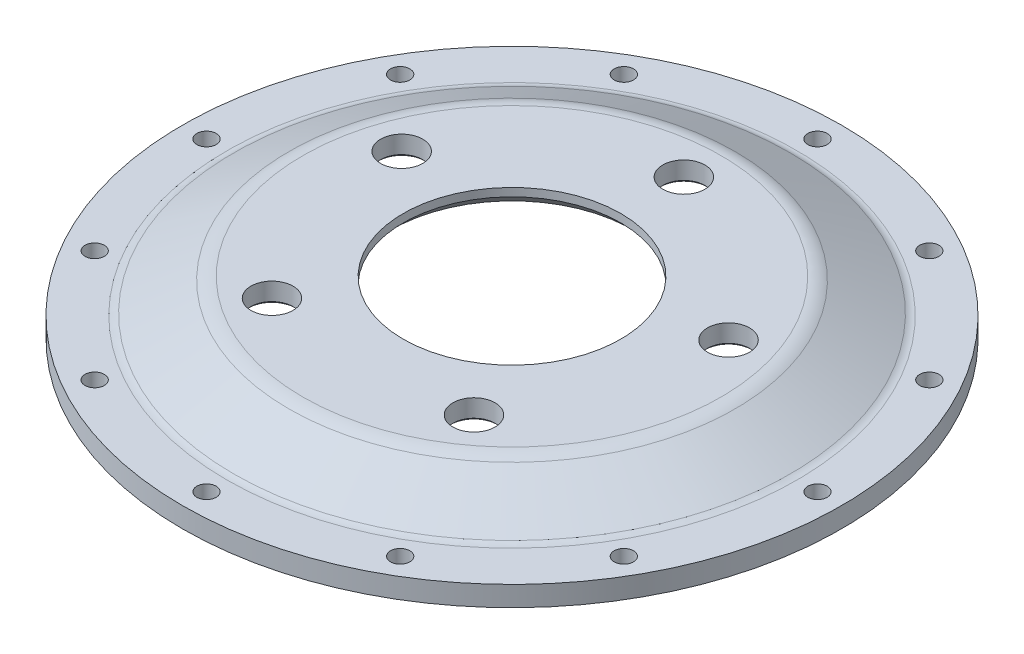
ISO-10303-21;
HEADER;
FILE_DESCRIPTION(('STEP AP214'),'2;1');
FILE_NAME('part.step','',(''),(''),'','','');
FILE_SCHEMA(('AUTOMOTIVE_DESIGN { 1 0 10303 214 1 1 1 1 }'));
ENDSEC;
DATA;
#1=APPLICATION_CONTEXT('core data for automotive mechanical design processes');
#2=APPLICATION_PROTOCOL_DEFINITION('international standard','automotive_design',2000,#1);
#3=PRODUCT_CONTEXT('',#1,'mechanical');
#4=PRODUCT('Part','Part','',(#3));
#5=PRODUCT_RELATED_PRODUCT_CATEGORY('part','',(#4));
#6=PRODUCT_DEFINITION_FORMATION('','',#4);
#7=PRODUCT_DEFINITION_CONTEXT('part definition',#1,'design');
#8=PRODUCT_DEFINITION('design','',#6,#7);
#9=PRODUCT_DEFINITION_SHAPE('','',#8);
#10=(LENGTH_UNIT() NAMED_UNIT(*) SI_UNIT(.MILLI.,.METRE.));
#11=(NAMED_UNIT(*) PLANE_ANGLE_UNIT() SI_UNIT($,.RADIAN.));
#12=(NAMED_UNIT(*) SI_UNIT($,.STERADIAN.) SOLID_ANGLE_UNIT());
#13=UNCERTAINTY_MEASURE_WITH_UNIT(LENGTH_MEASURE(1.E-05),#10,'distance_accuracy_value','');
#14=(GEOMETRIC_REPRESENTATION_CONTEXT(3) GLOBAL_UNCERTAINTY_ASSIGNED_CONTEXT((#13)) GLOBAL_UNIT_ASSIGNED_CONTEXT((#10,
#11,#12)) REPRESENTATION_CONTEXT('',''));
#15=CARTESIAN_POINT('',(0.,0.,0.));
#16=DIRECTION('',(0.,0.,1.));
#17=DIRECTION('',(1.,0.,0.));
#18=AXIS2_PLACEMENT_3D('',#15,#16,#17);
#19=CARTESIAN_POINT('',(0.,6.7,0.));
#20=DIRECTION('',(0.,1.,0.));
#21=DIRECTION('',(0.,0.,1.));
#22=AXIS2_PLACEMENT_3D('',#19,#20,#21);
#23=PLANE('',#22);
#24=CARTESIAN_POINT('',(0.,6.7,0.));
#25=DIRECTION('',(0.,1.,0.));
#26=DIRECTION('',(0.,0.,1.));
#27=AXIS2_PLACEMENT_3D('',#24,#25,#26);
#28=CIRCLE('',#27,94.8240473021878);
#29=CARTESIAN_POINT('',(0.,6.7,94.8240473021878));
#30=VERTEX_POINT('',#29);
#31=EDGE_CURVE('E86',#30,#30,#28,.F.);
#32=ORIENTED_EDGE('',*,*,#31,.T.);
#33=EDGE_LOOP('',(#32));
#34=FACE_BOUND('',#33,.T.);
#35=CARTESIAN_POINT('',(-87.9881810244954,6.7,-50.7999999999937));
#36=DIRECTION('',(0.,1.,0.));
#37=DIRECTION('',(0.,0.,1.));
#38=AXIS2_PLACEMENT_3D('',#35,#36,#37);
#39=CIRCLE('',#38,3.21250000000649);
#40=CARTESIAN_POINT('',(-87.9881810244954,6.7,-47.5874999999872));
#41=VERTEX_POINT('',#40);
#42=EDGE_CURVE('E162',#41,#41,#39,.T.);
#43=ORIENTED_EDGE('',*,*,#42,.F.);
#44=EDGE_LOOP('',(#43));
#45=FACE_BOUND('',#44,.T.);
#46=CARTESIAN_POINT('',(-87.9881810244881,6.7,50.8000000000063));
#47=DIRECTION('',(0.,1.,0.));
#48=DIRECTION('',(0.,0.,1.));
#49=AXIS2_PLACEMENT_3D('',#46,#47,#48);
#50=CIRCLE('',#49,3.21250000001312);
#51=CARTESIAN_POINT('',(-87.9881810244881,6.7,54.0125000000194));
#52=VERTEX_POINT('',#51);
#53=EDGE_CURVE('E150',#52,#52,#50,.T.);
#54=ORIENTED_EDGE('',*,*,#53,.F.);
#55=EDGE_LOOP('',(#54));
#56=FACE_BOUND('',#55,.T.);
#57=CARTESIAN_POINT('',(1.44154174917238E-11,6.7,101.6));
#58=DIRECTION('',(0.,1.,0.));
#59=DIRECTION('',(0.,0.,1.));
#60=AXIS2_PLACEMENT_3D('',#57,#58,#59);
#61=CIRCLE('',#60,3.21250000001446);
#62=CARTESIAN_POINT('',(1.44154174917238E-11,6.7,104.812500000014));
#63=VERTEX_POINT('',#62);
#64=EDGE_CURVE('E138',#63,#63,#61,.T.);
#65=ORIENTED_EDGE('',*,*,#64,.F.);
#66=EDGE_LOOP('',(#65));
#67=FACE_BOUND('',#66,.T.);
#68=CARTESIAN_POINT('',(87.9881810245098,6.7,50.7999999999937));
#69=DIRECTION('',(0.,1.,0.));
#70=DIRECTION('',(0.,0.,1.));
#71=AXIS2_PLACEMENT_3D('',#68,#69,#70);
#72=CIRCLE('',#71,3.21250000000898);
#73=CARTESIAN_POINT('',(87.9881810245098,6.7,54.0125000000027));
#74=VERTEX_POINT('',#73);
#75=EDGE_CURVE('E126',#74,#74,#72,.T.);
#76=ORIENTED_EDGE('',*,*,#75,.F.);
#77=EDGE_LOOP('',(#76));
#78=FACE_BOUND('',#77,.T.);
#79=CARTESIAN_POINT('',(87.9881810245026,6.7,-50.8000000000062));
#80=DIRECTION('',(0.,1.,0.));
#81=DIRECTION('',(0.,0.,1.));
#82=AXIS2_PLACEMENT_3D('',#79,#80,#81);
#83=CIRCLE('',#82,3.21250000000187);
#84=CARTESIAN_POINT('',(87.9881810245026,6.7,-47.5875000000044));
#85=VERTEX_POINT('',#84);
#86=EDGE_CURVE('E114',#85,#85,#83,.T.);
#87=ORIENTED_EDGE('',*,*,#86,.F.);
#88=EDGE_LOOP('',(#87));
#89=FACE_BOUND('',#88,.T.);
#90=CARTESIAN_POINT('',(0.,6.7,-101.6));
#91=DIRECTION('',(0.,1.,0.));
#92=DIRECTION('',(0.,0.,1.));
#93=AXIS2_PLACEMENT_3D('',#90,#91,#92);
#94=CIRCLE('',#93,3.2125);
#95=CARTESIAN_POINT('',(0.,6.7,-98.3875));
#96=VERTEX_POINT('',#95);
#97=EDGE_CURVE('E102',#96,#96,#94,.T.);
#98=ORIENTED_EDGE('',*,*,#97,.F.);
#99=EDGE_LOOP('',(#98));
#100=FACE_BOUND('',#99,.T.);
#101=CARTESIAN_POINT('',(0.,6.7,0.));
#102=DIRECTION('',(0.,1.,0.));
#103=DIRECTION('',(0.,0.,1.));
#104=AXIS2_PLACEMENT_3D('',#101,#102,#103);
#105=CIRCLE('',#104,109.6);
#106=CARTESIAN_POINT('',(0.,6.7,109.6));
#107=VERTEX_POINT('',#106);
#108=EDGE_CURVE('E98',#107,#107,#105,.T.);
#109=ORIENTED_EDGE('',*,*,#108,.T.);
#110=EDGE_LOOP('',(#109));
#111=FACE_BOUND('',#110,.T.);
#112=CARTESIAN_POINT('',(50.800000000001,6.7,-87.9881810245026));
#113=DIRECTION('',(0.,1.,0.));
#114=DIRECTION('',(0.,0.,1.));
#115=AXIS2_PLACEMENT_3D('',#112,#113,#114);
#116=CIRCLE('',#115,3.21249999999997);
#117=CARTESIAN_POINT('',(50.800000000001,6.7,-84.7756810245026));
#118=VERTEX_POINT('',#117);
#119=EDGE_CURVE('E108',#118,#118,#116,.T.);
#120=ORIENTED_EDGE('',*,*,#119,.F.);
#121=EDGE_LOOP('',(#120));
#122=FACE_BOUND('',#121,.T.);
#123=CARTESIAN_POINT('',(101.600000000007,6.7,-7.20667178384328E-12));
#124=DIRECTION('',(0.,1.,0.));
#125=DIRECTION('',(0.,0.,1.));
#126=AXIS2_PLACEMENT_3D('',#123,#124,#125);
#127=CIRCLE('',#126,3.21250000000512);
#128=CARTESIAN_POINT('',(101.600000000007,6.7,3.21249999999792));
#129=VERTEX_POINT('',#128);
#130=EDGE_CURVE('E120',#129,#129,#127,.T.);
#131=ORIENTED_EDGE('',*,*,#130,.F.);
#132=EDGE_LOOP('',(#131));
#133=FACE_BOUND('',#132,.T.);
#134=CARTESIAN_POINT('',(50.8000000000135,6.7,87.9881810244953));
#135=DIRECTION('',(0.,1.,0.));
#136=DIRECTION('',(0.,0.,1.));
#137=AXIS2_PLACEMENT_3D('',#134,#135,#136);
#138=CIRCLE('',#137,3.21250000001241);
#139=CARTESIAN_POINT('',(50.8000000000135,6.7,91.2006810245078));
#140=VERTEX_POINT('',#139);
#141=EDGE_CURVE('E132',#140,#140,#138,.T.);
#142=ORIENTED_EDGE('',*,*,#141,.F.);
#143=EDGE_LOOP('',(#142));
#144=FACE_BOUND('',#143,.T.);
#145=CARTESIAN_POINT('',(-50.7999999999865,6.7,87.9881810245026));
#146=DIRECTION('',(0.,1.,0.));
#147=DIRECTION('',(0.,0.,1.));
#148=AXIS2_PLACEMENT_3D('',#145,#146,#147);
#149=CIRCLE('',#148,3.21250000001473);
#150=CARTESIAN_POINT('',(-50.7999999999865,6.7,91.2006810245173));
#151=VERTEX_POINT('',#150);
#152=EDGE_CURVE('E144',#151,#151,#149,.T.);
#153=ORIENTED_EDGE('',*,*,#152,.F.);
#154=EDGE_LOOP('',(#153));
#155=FACE_BOUND('',#154,.T.);
#156=CARTESIAN_POINT('',(-101.599999999993,6.7,7.21911419532262E-12));
#157=DIRECTION('',(0.,1.,0.));
#158=DIRECTION('',(0.,0.,1.));
#159=AXIS2_PLACEMENT_3D('',#156,#157,#158);
#160=CIRCLE('',#159,3.21250000001003);
#161=CARTESIAN_POINT('',(-101.599999999993,6.7,3.21250000001725));
#162=VERTEX_POINT('',#161);
#163=EDGE_CURVE('E156',#162,#162,#160,.T.);
#164=ORIENTED_EDGE('',*,*,#163,.F.);
#165=EDGE_LOOP('',(#164));
#166=FACE_BOUND('',#165,.T.);
#167=CARTESIAN_POINT('',(-50.7999999999991,6.7,-87.9881810244953));
#168=DIRECTION('',(0.,1.,0.));
#169=DIRECTION('',(0.,0.,1.));
#170=AXIS2_PLACEMENT_3D('',#167,#168,#169);
#171=CIRCLE('',#170,3.21250000000327);
#172=CARTESIAN_POINT('',(-50.7999999999991,6.7,-84.7756810244921));
#173=VERTEX_POINT('',#172);
#174=EDGE_CURVE('E168',#173,#173,#171,.T.);
#175=ORIENTED_EDGE('',*,*,#174,.F.);
#176=EDGE_LOOP('',(#175));
#177=FACE_BOUND('',#176,.T.);
#178=ADVANCED_FACE('F30',(#34,#45,#56,#67,#78,#89,#100,#111,#122,#133,#144,#155,#166,#177),#23,.T.);
#179=CARTESIAN_POINT('',(0.,0.,0.));
#180=DIRECTION('',(0.,1.,0.));
#181=DIRECTION('',(0.,0.,1.));
#182=AXIS2_PLACEMENT_3D('',#179,#180,#181);
#183=PLANE('',#182);
#184=CARTESIAN_POINT('',(0.,0.,0.));
#185=DIRECTION('',(0.,1.,0.));
#186=DIRECTION('',(0.,0.,1.));
#187=AXIS2_PLACEMENT_3D('',#184,#185,#186);
#188=CIRCLE('',#187,94.2120236510939);
#189=CARTESIAN_POINT('',(0.,0.,94.2120236510939));
#190=VERTEX_POINT('',#189);
#191=EDGE_CURVE('E10',#190,#190,#188,.T.);
#192=ORIENTED_EDGE('',*,*,#191,.T.);
#193=EDGE_LOOP('',(#192));
#194=FACE_BOUND('',#193,.T.);
#195=CARTESIAN_POINT('',(-87.9881810244954,0.,-50.7999999999937));
#196=DIRECTION('',(0.,1.,0.));
#197=DIRECTION('',(0.,0.,1.));
#198=AXIS2_PLACEMENT_3D('',#195,#196,#197);
#199=CIRCLE('',#198,3.21250000000649);
#200=CARTESIAN_POINT('',(-87.9881810244954,0.,-47.5874999999872));
#201=VERTEX_POINT('',#200);
#202=EDGE_CURVE('E165',#201,#201,#199,.T.);
#203=ORIENTED_EDGE('',*,*,#202,.T.);
#204=EDGE_LOOP('',(#203));
#205=FACE_BOUND('',#204,.T.);
#206=CARTESIAN_POINT('',(-87.9881810244881,0.,50.8000000000063));
#207=DIRECTION('',(0.,1.,0.));
#208=DIRECTION('',(0.,0.,1.));
#209=AXIS2_PLACEMENT_3D('',#206,#207,#208);
#210=CIRCLE('',#209,3.21250000001312);
#211=CARTESIAN_POINT('',(-87.9881810244881,0.,54.0125000000194));
#212=VERTEX_POINT('',#211);
#213=EDGE_CURVE('E153',#212,#212,#210,.T.);
#214=ORIENTED_EDGE('',*,*,#213,.T.);
#215=EDGE_LOOP('',(#214));
#216=FACE_BOUND('',#215,.T.);
#217=CARTESIAN_POINT('',(1.44154174917238E-11,0.,101.6));
#218=DIRECTION('',(0.,1.,0.));
#219=DIRECTION('',(0.,0.,1.));
#220=AXIS2_PLACEMENT_3D('',#217,#218,#219);
#221=CIRCLE('',#220,3.21250000001446);
#222=CARTESIAN_POINT('',(1.44154174917238E-11,0.,104.812500000014));
#223=VERTEX_POINT('',#222);
#224=EDGE_CURVE('E141',#223,#223,#221,.T.);
#225=ORIENTED_EDGE('',*,*,#224,.T.);
#226=EDGE_LOOP('',(#225));
#227=FACE_BOUND('',#226,.T.);
#228=CARTESIAN_POINT('',(87.9881810245098,0.,50.7999999999937));
#229=DIRECTION('',(0.,1.,0.));
#230=DIRECTION('',(0.,0.,1.));
#231=AXIS2_PLACEMENT_3D('',#228,#229,#230);
#232=CIRCLE('',#231,3.21250000000898);
#233=CARTESIAN_POINT('',(87.9881810245098,0.,54.0125000000027));
#234=VERTEX_POINT('',#233);
#235=EDGE_CURVE('E129',#234,#234,#232,.T.);
#236=ORIENTED_EDGE('',*,*,#235,.T.);
#237=EDGE_LOOP('',(#236));
#238=FACE_BOUND('',#237,.T.);
#239=CARTESIAN_POINT('',(87.9881810245026,0.,-50.8000000000062));
#240=DIRECTION('',(0.,1.,0.));
#241=DIRECTION('',(0.,0.,1.));
#242=AXIS2_PLACEMENT_3D('',#239,#240,#241);
#243=CIRCLE('',#242,3.21250000000187);
#244=CARTESIAN_POINT('',(87.9881810245026,0.,-47.5875000000044));
#245=VERTEX_POINT('',#244);
#246=EDGE_CURVE('E117',#245,#245,#243,.T.);
#247=ORIENTED_EDGE('',*,*,#246,.T.);
#248=EDGE_LOOP('',(#247));
#249=FACE_BOUND('',#248,.T.);
#250=CARTESIAN_POINT('',(0.,0.,-101.6));
#251=DIRECTION('',(0.,1.,0.));
#252=DIRECTION('',(0.,0.,1.));
#253=AXIS2_PLACEMENT_3D('',#250,#251,#252);
#254=CIRCLE('',#253,3.2125);
#255=CARTESIAN_POINT('',(0.,0.,-98.3875));
#256=VERTEX_POINT('',#255);
#257=EDGE_CURVE('E105',#256,#256,#254,.T.);
#258=ORIENTED_EDGE('',*,*,#257,.T.);
#259=EDGE_LOOP('',(#258));
#260=FACE_BOUND('',#259,.T.);
#261=CARTESIAN_POINT('',(0.,0.,0.));
#262=DIRECTION('',(0.,1.,0.));
#263=DIRECTION('',(0.,0.,1.));
#264=AXIS2_PLACEMENT_3D('',#261,#262,#263);
#265=CIRCLE('',#264,109.6);
#266=CARTESIAN_POINT('',(0.,0.,109.6));
#267=VERTEX_POINT('',#266);
#268=EDGE_CURVE('E99',#267,#267,#265,.T.);
#269=ORIENTED_EDGE('',*,*,#268,.F.);
#270=EDGE_LOOP('',(#269));
#271=FACE_BOUND('',#270,.T.);
#272=CARTESIAN_POINT('',(50.800000000001,0.,-87.9881810245026));
#273=DIRECTION('',(0.,1.,0.));
#274=DIRECTION('',(0.,0.,1.));
#275=AXIS2_PLACEMENT_3D('',#272,#273,#274);
#276=CIRCLE('',#275,3.21249999999997);
#277=CARTESIAN_POINT('',(50.800000000001,0.,-84.7756810245026));
#278=VERTEX_POINT('',#277);
#279=EDGE_CURVE('E111',#278,#278,#276,.T.);
#280=ORIENTED_EDGE('',*,*,#279,.T.);
#281=EDGE_LOOP('',(#280));
#282=FACE_BOUND('',#281,.T.);
#283=CARTESIAN_POINT('',(101.600000000007,0.,-7.20667178384328E-12));
#284=DIRECTION('',(0.,1.,0.));
#285=DIRECTION('',(0.,0.,1.));
#286=AXIS2_PLACEMENT_3D('',#283,#284,#285);
#287=CIRCLE('',#286,3.21250000000512);
#288=CARTESIAN_POINT('',(101.600000000007,0.,3.21249999999792));
#289=VERTEX_POINT('',#288);
#290=EDGE_CURVE('E123',#289,#289,#287,.T.);
#291=ORIENTED_EDGE('',*,*,#290,.T.);
#292=EDGE_LOOP('',(#291));
#293=FACE_BOUND('',#292,.T.);
#294=CARTESIAN_POINT('',(50.8000000000135,0.,87.9881810244953));
#295=DIRECTION('',(0.,1.,0.));
#296=DIRECTION('',(0.,0.,1.));
#297=AXIS2_PLACEMENT_3D('',#294,#295,#296);
#298=CIRCLE('',#297,3.21250000001241);
#299=CARTESIAN_POINT('',(50.8000000000135,0.,91.2006810245078));
#300=VERTEX_POINT('',#299);
#301=EDGE_CURVE('E135',#300,#300,#298,.T.);
#302=ORIENTED_EDGE('',*,*,#301,.T.);
#303=EDGE_LOOP('',(#302));
#304=FACE_BOUND('',#303,.T.);
#305=CARTESIAN_POINT('',(-50.7999999999865,0.,87.9881810245026));
#306=DIRECTION('',(0.,1.,0.));
#307=DIRECTION('',(0.,0.,1.));
#308=AXIS2_PLACEMENT_3D('',#305,#306,#307);
#309=CIRCLE('',#308,3.21250000001473);
#310=CARTESIAN_POINT('',(-50.7999999999865,0.,91.2006810245173));
#311=VERTEX_POINT('',#310);
#312=EDGE_CURVE('E147',#311,#311,#309,.T.);
#313=ORIENTED_EDGE('',*,*,#312,.T.);
#314=EDGE_LOOP('',(#313));
#315=FACE_BOUND('',#314,.T.);
#316=CARTESIAN_POINT('',(-101.599999999993,0.,7.21911419532262E-12));
#317=DIRECTION('',(0.,1.,0.));
#318=DIRECTION('',(0.,0.,1.));
#319=AXIS2_PLACEMENT_3D('',#316,#317,#318);
#320=CIRCLE('',#319,3.21250000001003);
#321=CARTESIAN_POINT('',(-101.599999999993,0.,3.21250000001725));
#322=VERTEX_POINT('',#321);
#323=EDGE_CURVE('E159',#322,#322,#320,.T.);
#324=ORIENTED_EDGE('',*,*,#323,.T.);
#325=EDGE_LOOP('',(#324));
#326=FACE_BOUND('',#325,.T.);
#327=CARTESIAN_POINT('',(-50.7999999999991,0.,-87.9881810244953));
#328=DIRECTION('',(0.,1.,0.));
#329=DIRECTION('',(0.,0.,1.));
#330=AXIS2_PLACEMENT_3D('',#327,#328,#329);
#331=CIRCLE('',#330,3.21250000000327);
#332=CARTESIAN_POINT('',(-50.7999999999991,0.,-84.7756810244921));
#333=VERTEX_POINT('',#332);
#334=EDGE_CURVE('E171',#333,#333,#331,.T.);
#335=ORIENTED_EDGE('',*,*,#334,.T.);
#336=EDGE_LOOP('',(#335));
#337=FACE_BOUND('',#336,.T.);
#338=ADVANCED_FACE('F226',(#194,#205,#216,#227,#238,#249,#260,#271,#282,#293,#304,#315,#326,
#337),#183,.F.);
#339=CARTESIAN_POINT('',(0.,6.7,0.));
#340=DIRECTION('',(0.,-1.,0.));
#341=DIRECTION('',(0.,0.,-1.));
#342=AXIS2_PLACEMENT_3D('',#339,#340,#341);
#343=CYLINDRICAL_SURFACE('',#342,109.6);
#344=ORIENTED_EDGE('',*,*,#108,.F.);
#345=EDGE_LOOP('',(#344));
#346=FACE_BOUND('',#345,.T.);
#347=ORIENTED_EDGE('',*,*,#268,.T.);
#348=EDGE_LOOP('',(#347));
#349=FACE_BOUND('',#348,.T.);
#350=ADVANCED_FACE('F232',(#346,#349),#343,.T.);
#351=CARTESIAN_POINT('',(0.,6.7,-101.6));
#352=DIRECTION('',(0.,-1.,0.));
#353=DIRECTION('',(0.,0.,-1.));
#354=AXIS2_PLACEMENT_3D('',#351,#352,#353);
#355=CYLINDRICAL_SURFACE('',#354,3.2125);
#356=ORIENTED_EDGE('',*,*,#97,.T.);
#357=EDGE_LOOP('',(#356));
#358=FACE_BOUND('',#357,.T.);
#359=ORIENTED_EDGE('',*,*,#257,.F.);
#360=EDGE_LOOP('',(#359));
#361=FACE_BOUND('',#360,.T.);
#362=ADVANCED_FACE('F236',(#358,#361),#355,.F.);
#363=CARTESIAN_POINT('',(50.800000000001,6.7,-87.9881810245026));
#364=DIRECTION('',(0.,-1.,0.));
#365=DIRECTION('',(0.,0.,-1.));
#366=AXIS2_PLACEMENT_3D('',#363,#364,#365);
#367=CYLINDRICAL_SURFACE('',#366,3.21249999999997);
#368=ORIENTED_EDGE('',*,*,#119,.T.);
#369=EDGE_LOOP('',(#368));
#370=FACE_BOUND('',#369,.T.);
#371=ORIENTED_EDGE('',*,*,#279,.F.);
#372=EDGE_LOOP('',(#371));
#373=FACE_BOUND('',#372,.T.);
#374=ADVANCED_FACE('F351',(#370,#373),#367,.F.);
#375=CARTESIAN_POINT('',(87.9881810245026,6.7,-50.8000000000062));
#376=DIRECTION('',(0.,-1.,0.));
#377=DIRECTION('',(0.,0.,-1.));
#378=AXIS2_PLACEMENT_3D('',#375,#376,#377);
#379=CYLINDRICAL_SURFACE('',#378,3.21250000000187);
#380=ORIENTED_EDGE('',*,*,#86,.T.);
#381=EDGE_LOOP('',(#380));
#382=FACE_BOUND('',#381,.T.);
#383=ORIENTED_EDGE('',*,*,#246,.F.);
#384=EDGE_LOOP('',(#383));
#385=FACE_BOUND('',#384,.T.);
#386=ADVANCED_FACE('F348',(#382,#385),#379,.F.);
#387=CARTESIAN_POINT('',(101.600000000007,6.7,-7.20667178384328E-12));
#388=DIRECTION('',(0.,-1.,0.));
#389=DIRECTION('',(0.,0.,-1.));
#390=AXIS2_PLACEMENT_3D('',#387,#388,#389);
#391=CYLINDRICAL_SURFACE('',#390,3.21250000000512);
#392=ORIENTED_EDGE('',*,*,#130,.T.);
#393=EDGE_LOOP('',(#392));
#394=FACE_BOUND('',#393,.T.);
#395=ORIENTED_EDGE('',*,*,#290,.F.);
#396=EDGE_LOOP('',(#395));
#397=FACE_BOUND('',#396,.T.);
#398=ADVANCED_FACE('F344',(#394,#397),#391,.F.);
#399=CARTESIAN_POINT('',(87.9881810245098,6.7,50.7999999999937));
#400=DIRECTION('',(0.,-1.,0.));
#401=DIRECTION('',(0.,0.,-1.));
#402=AXIS2_PLACEMENT_3D('',#399,#400,#401);
#403=CYLINDRICAL_SURFACE('',#402,3.21250000000898);
#404=ORIENTED_EDGE('',*,*,#75,.T.);
#405=EDGE_LOOP('',(#404));
#406=FACE_BOUND('',#405,.T.);
#407=ORIENTED_EDGE('',*,*,#235,.F.);
#408=EDGE_LOOP('',(#407));
#409=FACE_BOUND('',#408,.T.);
#410=ADVANCED_FACE('F340',(#406,#409),#403,.F.);
#411=CARTESIAN_POINT('',(50.8000000000135,6.7,87.9881810244953));
#412=DIRECTION('',(0.,-1.,0.));
#413=DIRECTION('',(0.,0.,-1.));
#414=AXIS2_PLACEMENT_3D('',#411,#412,#413);
#415=CYLINDRICAL_SURFACE('',#414,3.21250000001241);
#416=ORIENTED_EDGE('',*,*,#141,.T.);
#417=EDGE_LOOP('',(#416));
#418=FACE_BOUND('',#417,.T.);
#419=ORIENTED_EDGE('',*,*,#301,.F.);
#420=EDGE_LOOP('',(#419));
#421=FACE_BOUND('',#420,.T.);
#422=ADVANCED_FACE('F336',(#418,#421),#415,.F.);
#423=CARTESIAN_POINT('',(1.44154174917238E-11,6.7,101.6));
#424=DIRECTION('',(0.,-1.,0.));
#425=DIRECTION('',(0.,0.,-1.));
#426=AXIS2_PLACEMENT_3D('',#423,#424,#425);
#427=CYLINDRICAL_SURFACE('',#426,3.21250000001446);
#428=ORIENTED_EDGE('',*,*,#64,.T.);
#429=EDGE_LOOP('',(#428));
#430=FACE_BOUND('',#429,.T.);
#431=ORIENTED_EDGE('',*,*,#224,.F.);
#432=EDGE_LOOP('',(#431));
#433=FACE_BOUND('',#432,.T.);
#434=ADVANCED_FACE('F332',(#430,#433),#427,.F.);
#435=CARTESIAN_POINT('',(-50.7999999999865,6.7,87.9881810245026));
#436=DIRECTION('',(0.,-1.,0.));
#437=DIRECTION('',(0.,0.,-1.));
#438=AXIS2_PLACEMENT_3D('',#435,#436,#437);
#439=CYLINDRICAL_SURFACE('',#438,3.21250000001473);
#440=ORIENTED_EDGE('',*,*,#152,.T.);
#441=EDGE_LOOP('',(#440));
#442=FACE_BOUND('',#441,.T.);
#443=ORIENTED_EDGE('',*,*,#312,.F.);
#444=EDGE_LOOP('',(#443));
#445=FACE_BOUND('',#444,.T.);
#446=ADVANCED_FACE('F328',(#442,#445),#439,.F.);
#447=CARTESIAN_POINT('',(-87.9881810244881,6.7,50.8000000000063));
#448=DIRECTION('',(0.,-1.,0.));
#449=DIRECTION('',(0.,0.,-1.));
#450=AXIS2_PLACEMENT_3D('',#447,#448,#449);
#451=CYLINDRICAL_SURFACE('',#450,3.21250000001312);
#452=ORIENTED_EDGE('',*,*,#53,.T.);
#453=EDGE_LOOP('',(#452));
#454=FACE_BOUND('',#453,.T.);
#455=ORIENTED_EDGE('',*,*,#213,.F.);
#456=EDGE_LOOP('',(#455));
#457=FACE_BOUND('',#456,.T.);
#458=ADVANCED_FACE('F324',(#454,#457),#451,.F.);
#459=CARTESIAN_POINT('',(-101.599999999993,6.7,7.21911419532262E-12));
#460=DIRECTION('',(0.,-1.,0.));
#461=DIRECTION('',(0.,0.,-1.));
#462=AXIS2_PLACEMENT_3D('',#459,#460,#461);
#463=CYLINDRICAL_SURFACE('',#462,3.21250000001003);
#464=ORIENTED_EDGE('',*,*,#163,.T.);
#465=EDGE_LOOP('',(#464));
#466=FACE_BOUND('',#465,.T.);
#467=ORIENTED_EDGE('',*,*,#323,.F.);
#468=EDGE_LOOP('',(#467));
#469=FACE_BOUND('',#468,.T.);
#470=ADVANCED_FACE('F320',(#466,#469),#463,.F.);
#471=CARTESIAN_POINT('',(-87.9881810244954,6.7,-50.7999999999937));
#472=DIRECTION('',(0.,-1.,0.));
#473=DIRECTION('',(0.,0.,-1.));
#474=AXIS2_PLACEMENT_3D('',#471,#472,#473);
#475=CYLINDRICAL_SURFACE('',#474,3.21250000000649);
#476=ORIENTED_EDGE('',*,*,#42,.T.);
#477=EDGE_LOOP('',(#476));
#478=FACE_BOUND('',#477,.T.);
#479=ORIENTED_EDGE('',*,*,#202,.F.);
#480=EDGE_LOOP('',(#479));
#481=FACE_BOUND('',#480,.T.);
#482=ADVANCED_FACE('F316',(#478,#481),#475,.F.);
#483=CARTESIAN_POINT('',(-50.7999999999991,6.7,-87.9881810244953));
#484=DIRECTION('',(0.,-1.,0.));
#485=DIRECTION('',(0.,0.,-1.));
#486=AXIS2_PLACEMENT_3D('',#483,#484,#485);
#487=CYLINDRICAL_SURFACE('',#486,3.21250000000327);
#488=ORIENTED_EDGE('',*,*,#174,.T.);
#489=EDGE_LOOP('',(#488));
#490=FACE_BOUND('',#489,.T.);
#491=ORIENTED_EDGE('',*,*,#334,.F.);
#492=EDGE_LOOP('',(#491));
#493=FACE_BOUND('',#492,.T.);
#494=ADVANCED_FACE('F312',(#490,#493),#487,.F.);
#495=CARTESIAN_POINT('',(0.,6.7,0.));
#496=DIRECTION('',(0.,-1.,0.));
#497=DIRECTION('',(0.,0.,-1.));
#498=AXIS2_PLACEMENT_3D('',#495,#496,#497);
#499=CONICAL_SURFACE('',#498,93.6,1.09062129719137);
#500=CARTESIAN_POINT('',(0.,7.26542957916509,0.));
#501=DIRECTION('',(0.,-1.,0.));
#502=DIRECTION('',(0.,0.,-1.));
#503=AXIS2_PLACEMENT_3D('',#500,#501,#502);
#504=CIRCLE('',#503,92.514375208003);
#505=CARTESIAN_POINT('',(0.,7.26542957916509,-92.514375208003));
#506=VERTEX_POINT('',#505);
#507=EDGE_CURVE('E89',#506,#506,#504,.F.);
#508=ORIENTED_EDGE('',*,*,#507,.T.);
#509=EDGE_LOOP('',(#508));
#510=FACE_BOUND('',#509,.T.);
#511=CARTESIAN_POINT('',(0.,16.8191408416698,0.));
#512=DIRECTION('',(0.,1.,0.));
#513=DIRECTION('',(0.,0.,1.));
#514=AXIS2_PLACEMENT_3D('',#511,#512,#513);
#515=CIRCLE('',#514,74.171249583994);
#516=CARTESIAN_POINT('',(0.,16.8191408416698,74.171249583994));
#517=VERTEX_POINT('',#516);
#518=EDGE_CURVE('E92',#517,#517,#515,.F.);
#519=ORIENTED_EDGE('',*,*,#518,.T.);
#520=EDGE_LOOP('',(#519));
#521=FACE_BOUND('',#520,.T.);
#522=ADVANCED_FACE('F307',(#510,#521),#499,.T.);
#523=CARTESIAN_POINT('',(0.,11.25,0.));
#524=DIRECTION('',(0.,-1.,0.));
#525=DIRECTION('',(0.,0.,-1.));
#526=AXIS2_PLACEMENT_3D('',#523,#524,#525);
#527=CONICAL_SURFACE('',#526,72.,1.09062129719137);
#528=CARTESIAN_POINT('',(0.,0.282714789582583,0.));
#529=DIRECTION('',(0.,-1.,0.));
#530=DIRECTION('',(0.,0.,-1.));
#531=AXIS2_PLACEMENT_3D('',#528,#529,#530);
#532=CIRCLE('',#531,93.0571876040015);
#533=CARTESIAN_POINT('',(0.,0.282714789582583,-93.0571876040015));
#534=VERTEX_POINT('',#533);
#535=EDGE_CURVE('E37',#534,#534,#532,.T.);
#536=ORIENTED_EDGE('',*,*,#535,.T.);
#537=EDGE_LOOP('',(#536));
#538=FACE_BOUND('',#537,.T.);
#539=CARTESIAN_POINT('',(0.,10.9672852104175,0.));
#540=DIRECTION('',(0.,1.,0.));
#541=DIRECTION('',(0.,0.,1.));
#542=AXIS2_PLACEMENT_3D('',#539,#540,#541);
#543=CIRCLE('',#542,72.5428123959985);
#544=CARTESIAN_POINT('',(0.,10.9672852104175,72.5428123959985));
#545=VERTEX_POINT('',#544);
#546=EDGE_CURVE('E41',#545,#545,#543,.T.);
#547=ORIENTED_EDGE('',*,*,#546,.T.);
#548=EDGE_LOOP('',(#547));
#549=FACE_BOUND('',#548,.T.);
#550=ADVANCED_FACE('F286',(#538,#549),#527,.F.);
#551=CARTESIAN_POINT('',(0.,11.25,0.));
#552=DIRECTION('',(0.,1.,0.));
#553=DIRECTION('',(0.,0.,1.));
#554=AXIS2_PLACEMENT_3D('',#551,#552,#553);
#555=PLANE('',#554);
#556=CARTESIAN_POINT('',(0.,11.25,0.));
#557=DIRECTION('',(0.,1.,0.));
#558=DIRECTION('',(0.,0.,1.));
#559=AXIS2_PLACEMENT_3D('',#556,#557,#558);
#560=CIRCLE('',#559,71.3879763489061);
#561=CARTESIAN_POINT('',(0.,11.25,71.3879763489061));
#562=VERTEX_POINT('',#561);
#563=EDGE_CURVE('E45',#562,#562,#560,.F.);
#564=ORIENTED_EDGE('',*,*,#563,.T.);
#565=EDGE_LOOP('',(#564));
#566=FACE_BOUND('',#565,.T.);
#567=CARTESIAN_POINT('',(-2.41473507855972E-12,11.25,-57.15));
#568=DIRECTION('',(0.,1.,0.));
#569=DIRECTION('',(0.,0.,1.));
#570=AXIS2_PLACEMENT_3D('',#567,#568,#569);
#571=CIRCLE('',#570,7.80000000000224);
#572=CARTESIAN_POINT('',(-2.41473507855972E-12,11.25,-49.3499999999978));
#573=VERTEX_POINT('',#572);
#574=EDGE_CURVE('E65',#573,#573,#571,.T.);
#575=ORIENTED_EDGE('',*,*,#574,.T.);
#576=EDGE_LOOP('',(#575));
#577=FACE_BOUND('',#576,.T.);
#578=CARTESIAN_POINT('',(54.3528799062673,11.25,-17.6603212285306));
#579=DIRECTION('',(0.,1.,0.));
#580=DIRECTION('',(0.,0.,1.));
#581=AXIS2_PLACEMENT_3D('',#578,#579,#580);
#582=CIRCLE('',#581,7.80000000000245);
#583=CARTESIAN_POINT('',(54.3528799062673,11.25,-9.86032122852811));
#584=VERTEX_POINT('',#583);
#585=EDGE_CURVE('E68',#584,#584,#582,.T.);
#586=ORIENTED_EDGE('',*,*,#585,.T.);
#587=EDGE_LOOP('',(#586));
#588=FACE_BOUND('',#587,.T.);
#589=CARTESIAN_POINT('',(33.5919271685165,11.25,46.2353212285288));
#590=DIRECTION('',(0.,1.,0.));
#591=DIRECTION('',(0.,0.,1.));
#592=AXIS2_PLACEMENT_3D('',#589,#590,#591);
#593=CIRCLE('',#592,7.80000000000081);
#594=CARTESIAN_POINT('',(33.5919271685165,11.25,54.0353212285296));
#595=VERTEX_POINT('',#594);
#596=EDGE_CURVE('E71',#595,#595,#593,.T.);
#597=ORIENTED_EDGE('',*,*,#596,.T.);
#598=EDGE_LOOP('',(#597));
#599=FACE_BOUND('',#598,.T.);
#600=CARTESIAN_POINT('',(-33.5919271685144,11.25,46.2353212285314));
#601=DIRECTION('',(0.,1.,0.));
#602=DIRECTION('',(0.,0.,1.));
#603=AXIS2_PLACEMENT_3D('',#600,#601,#602);
#604=CIRCLE('',#603,7.80000000000189);
#605=CARTESIAN_POINT('',(-33.5919271685144,11.25,54.0353212285333));
#606=VERTEX_POINT('',#605);
#607=EDGE_CURVE('E74',#606,#606,#604,.T.);
#608=ORIENTED_EDGE('',*,*,#607,.T.);
#609=EDGE_LOOP('',(#608));
#610=FACE_BOUND('',#609,.T.);
#611=CARTESIAN_POINT('',(-54.3528799062704,11.25,-17.6603212285255));
#612=DIRECTION('',(0.,1.,0.));
#613=DIRECTION('',(0.,0.,1.));
#614=AXIS2_PLACEMENT_3D('',#611,#612,#613);
#615=CIRCLE('',#614,7.80000000000347);
#616=CARTESIAN_POINT('',(-54.3528799062704,11.25,-9.86032122852198));
#617=VERTEX_POINT('',#616);
#618=EDGE_CURVE('E77',#617,#617,#615,.T.);
#619=ORIENTED_EDGE('',*,*,#618,.T.);
#620=EDGE_LOOP('',(#619));
#621=FACE_BOUND('',#620,.T.);
#622=CARTESIAN_POINT('',(0.,11.25,0.));
#623=DIRECTION('',(0.,1.,0.));
#624=DIRECTION('',(0.,0.,1.));
#625=AXIS2_PLACEMENT_3D('',#622,#623,#624);
#626=CIRCLE('',#625,40.2);
#627=CARTESIAN_POINT('',(0.,11.25,40.2));
#628=VERTEX_POINT('',#627);
#629=EDGE_CURVE('E83',#628,#628,#626,.T.);
#630=ORIENTED_EDGE('',*,*,#629,.T.);
#631=EDGE_LOOP('',(#630));
#632=FACE_BOUND('',#631,.T.);
#633=ADVANCED_FACE('F201',(#566,#577,#588,#599,#610,#621,#632),#555,.F.);
#634=CARTESIAN_POINT('',(0.,17.95,0.));
#635=DIRECTION('',(0.,1.,0.));
#636=DIRECTION('',(0.,0.,1.));
#637=AXIS2_PLACEMENT_3D('',#634,#635,#636);
#638=PLANE('',#637);
#639=CARTESIAN_POINT('',(0.,17.95,0.));
#640=DIRECTION('',(0.,1.,0.));
#641=DIRECTION('',(0.,0.,1.));
#642=AXIS2_PLACEMENT_3D('',#639,#640,#641);
#643=CIRCLE('',#642,69.5519053956243);
#644=CARTESIAN_POINT('',(0.,17.95,69.5519053956243));
#645=VERTEX_POINT('',#644);
#646=EDGE_CURVE('E95',#645,#645,#643,.T.);
#647=ORIENTED_EDGE('',*,*,#646,.T.);
#648=EDGE_LOOP('',(#647));
#649=FACE_BOUND('',#648,.T.);
#650=CARTESIAN_POINT('',(-54.3528799062704,17.95,-17.6603212285255));
#651=DIRECTION('',(0.,1.,0.));
#652=DIRECTION('',(0.,0.,1.));
#653=AXIS2_PLACEMENT_3D('',#650,#651,#652);
#654=CIRCLE('',#653,7.00000000000345);
#655=CARTESIAN_POINT('',(-54.3528799062704,17.95,-10.660321228522));
#656=VERTEX_POINT('',#655);
#657=EDGE_CURVE('E191',#656,#656,#654,.T.);
#658=ORIENTED_EDGE('',*,*,#657,.F.);
#659=EDGE_LOOP('',(#658));
#660=FACE_BOUND('',#659,.T.);
#661=CARTESIAN_POINT('',(-33.5919271685144,17.95,46.2353212285314));
#662=DIRECTION('',(0.,1.,0.));
#663=DIRECTION('',(0.,0.,1.));
#664=AXIS2_PLACEMENT_3D('',#661,#662,#663);
#665=CIRCLE('',#664,7.00000000000188);
#666=CARTESIAN_POINT('',(-33.5919271685144,17.95,53.2353212285333));
#667=VERTEX_POINT('',#666);
#668=EDGE_CURVE('E188',#667,#667,#665,.T.);
#669=ORIENTED_EDGE('',*,*,#668,.F.);
#670=EDGE_LOOP('',(#669));
#671=FACE_BOUND('',#670,.T.);
#672=CARTESIAN_POINT('',(33.5919271685165,17.95,46.2353212285288));
#673=DIRECTION('',(0.,1.,0.));
#674=DIRECTION('',(0.,0.,1.));
#675=AXIS2_PLACEMENT_3D('',#672,#673,#674);
#676=CIRCLE('',#675,7.00000000000081);
#677=CARTESIAN_POINT('',(33.5919271685165,17.95,53.2353212285296));
#678=VERTEX_POINT('',#677);
#679=EDGE_CURVE('E185',#678,#678,#676,.T.);
#680=ORIENTED_EDGE('',*,*,#679,.F.);
#681=EDGE_LOOP('',(#680));
#682=FACE_BOUND('',#681,.T.);
#683=CARTESIAN_POINT('',(54.3528799062673,17.95,-17.6603212285306));
#684=DIRECTION('',(0.,1.,0.));
#685=DIRECTION('',(0.,0.,1.));
#686=AXIS2_PLACEMENT_3D('',#683,#684,#685);
#687=CIRCLE('',#686,7.00000000000248);
#688=CARTESIAN_POINT('',(54.3528799062673,17.95,-10.6603212285281));
#689=VERTEX_POINT('',#688);
#690=EDGE_CURVE('E182',#689,#689,#687,.T.);
#691=ORIENTED_EDGE('',*,*,#690,.F.);
#692=EDGE_LOOP('',(#691));
#693=FACE_BOUND('',#692,.T.);
#694=CARTESIAN_POINT('',(-2.41473507855972E-12,17.95,-57.15));
#695=DIRECTION('',(0.,1.,0.));
#696=DIRECTION('',(0.,0.,1.));
#697=AXIS2_PLACEMENT_3D('',#694,#695,#696);
#698=CIRCLE('',#697,7.00000000000231);
#699=CARTESIAN_POINT('',(-2.41473507855972E-12,17.95,-50.1499999999977));
#700=VERTEX_POINT('',#699);
#701=EDGE_CURVE('E179',#700,#700,#698,.T.);
#702=ORIENTED_EDGE('',*,*,#701,.F.);
#703=EDGE_LOOP('',(#702));
#704=FACE_BOUND('',#703,.T.);
#705=CARTESIAN_POINT('',(0.,17.95,0.));
#706=DIRECTION('',(0.,1.,0.));
#707=DIRECTION('',(0.,0.,1.));
#708=AXIS2_PLACEMENT_3D('',#705,#706,#707);
#709=CIRCLE('',#708,36.2);
#710=CARTESIAN_POINT('',(0.,17.95,36.2));
#711=VERTEX_POINT('',#710);
#712=EDGE_CURVE('E174',#711,#711,#709,.T.);
#713=ORIENTED_EDGE('',*,*,#712,.F.);
#714=EDGE_LOOP('',(#713));
#715=FACE_BOUND('',#714,.T.);
#716=ADVANCED_FACE('F197',(#649,#660,#671,#682,#693,#704,#715),#638,.T.);
#717=CARTESIAN_POINT('',(0.,11.25,0.));
#718=DIRECTION('',(0.,1.,0.));
#719=DIRECTION('',(0.,0.,1.));
#720=AXIS2_PLACEMENT_3D('',#717,#718,#719);
#721=CYLINDRICAL_SURFACE('',#720,36.2);
#722=CARTESIAN_POINT('',(0.,15.25,0.));
#723=DIRECTION('',(0.,1.,0.));
#724=DIRECTION('',(0.,0.,1.));
#725=AXIS2_PLACEMENT_3D('',#722,#723,#724);
#726=CIRCLE('',#725,36.2);
#727=CARTESIAN_POINT('',(0.,15.25,36.2));
#728=VERTEX_POINT('',#727);
#729=EDGE_CURVE('E80',#728,#728,#726,.F.);
#730=ORIENTED_EDGE('',*,*,#729,.T.);
#731=EDGE_LOOP('',(#730));
#732=FACE_BOUND('',#731,.T.);
#733=ORIENTED_EDGE('',*,*,#712,.T.);
#734=EDGE_LOOP('',(#733));
#735=FACE_BOUND('',#734,.T.);
#736=ADVANCED_FACE('F200',(#732,#735),#721,.F.);
#737=CARTESIAN_POINT('',(-2.41473507855972E-12,11.25,-57.15));
#738=DIRECTION('',(0.,1.,0.));
#739=DIRECTION('',(0.,0.,1.));
#740=AXIS2_PLACEMENT_3D('',#737,#738,#739);
#741=CYLINDRICAL_SURFACE('',#740,7.00000000000231);
#742=CARTESIAN_POINT('',(-2.41473507855972E-12,12.0499999999999,-57.15));
#743=DIRECTION('',(0.,1.,0.));
#744=DIRECTION('',(0.,0.,1.));
#745=AXIS2_PLACEMENT_3D('',#742,#743,#744);
#746=CIRCLE('',#745,7.00000000000231);
#747=CARTESIAN_POINT('',(-2.41473507855972E-12,12.0499999999999,-50.1499999999977));
#748=VERTEX_POINT('',#747);
#749=EDGE_CURVE('E62',#748,#748,#746,.F.);
#750=ORIENTED_EDGE('',*,*,#749,.T.);
#751=EDGE_LOOP('',(#750));
#752=FACE_BOUND('',#751,.T.);
#753=ORIENTED_EDGE('',*,*,#701,.T.);
#754=EDGE_LOOP('',(#753));
#755=FACE_BOUND('',#754,.T.);
#756=ADVANCED_FACE('F215',(#752,#755),#741,.F.);
#757=CARTESIAN_POINT('',(54.3528799062673,11.25,-17.6603212285306));
#758=DIRECTION('',(0.,1.,0.));
#759=DIRECTION('',(0.,0.,1.));
#760=AXIS2_PLACEMENT_3D('',#757,#758,#759);
#761=CYLINDRICAL_SURFACE('',#760,7.00000000000248);
#762=CARTESIAN_POINT('',(54.3528799062673,12.05,-17.6603212285306));
#763=DIRECTION('',(0.,1.,0.));
#764=DIRECTION('',(0.,0.,1.));
#765=AXIS2_PLACEMENT_3D('',#762,#763,#764);
#766=CIRCLE('',#765,7.00000000000248);
#767=CARTESIAN_POINT('',(54.3528799062673,12.05,-10.6603212285281));
#768=VERTEX_POINT('',#767);
#769=EDGE_CURVE('E59',#768,#768,#766,.F.);
#770=ORIENTED_EDGE('',*,*,#769,.T.);
#771=EDGE_LOOP('',(#770));
#772=FACE_BOUND('',#771,.T.);
#773=ORIENTED_EDGE('',*,*,#690,.T.);
#774=EDGE_LOOP('',(#773));
#775=FACE_BOUND('',#774,.T.);
#776=ADVANCED_FACE('F221',(#772,#775),#761,.F.);
#777=CARTESIAN_POINT('',(33.5919271685165,11.25,46.2353212285288));
#778=DIRECTION('',(0.,1.,0.));
#779=DIRECTION('',(0.,0.,1.));
#780=AXIS2_PLACEMENT_3D('',#777,#778,#779);
#781=CYLINDRICAL_SURFACE('',#780,7.00000000000081);
#782=CARTESIAN_POINT('',(33.5919271685165,12.05,46.2353212285288));
#783=DIRECTION('',(0.,1.,0.));
#784=DIRECTION('',(0.,0.,1.));
#785=AXIS2_PLACEMENT_3D('',#782,#783,#784);
#786=CIRCLE('',#785,7.00000000000081);
#787=CARTESIAN_POINT('',(33.5919271685165,12.05,53.2353212285296));
#788=VERTEX_POINT('',#787);
#789=EDGE_CURVE('E56',#788,#788,#786,.F.);
#790=ORIENTED_EDGE('',*,*,#789,.T.);
#791=EDGE_LOOP('',(#790));
#792=FACE_BOUND('',#791,.T.);
#793=ORIENTED_EDGE('',*,*,#679,.T.);
#794=EDGE_LOOP('',(#793));
#795=FACE_BOUND('',#794,.T.);
#796=ADVANCED_FACE('F575',(#792,#795),#781,.F.);
#797=CARTESIAN_POINT('',(-33.5919271685144,11.25,46.2353212285314));
#798=DIRECTION('',(0.,1.,0.));
#799=DIRECTION('',(0.,0.,1.));
#800=AXIS2_PLACEMENT_3D('',#797,#798,#799);
#801=CYLINDRICAL_SURFACE('',#800,7.00000000000188);
#802=CARTESIAN_POINT('',(-33.5919271685144,12.05,46.2353212285314));
#803=DIRECTION('',(0.,1.,0.));
#804=DIRECTION('',(0.,0.,1.));
#805=AXIS2_PLACEMENT_3D('',#802,#803,#804);
#806=CIRCLE('',#805,7.00000000000188);
#807=CARTESIAN_POINT('',(-33.5919271685144,12.05,53.2353212285333));
#808=VERTEX_POINT('',#807);
#809=EDGE_CURVE('E53',#808,#808,#806,.F.);
#810=ORIENTED_EDGE('',*,*,#809,.T.);
#811=EDGE_LOOP('',(#810));
#812=FACE_BOUND('',#811,.T.);
#813=ORIENTED_EDGE('',*,*,#668,.T.);
#814=EDGE_LOOP('',(#813));
#815=FACE_BOUND('',#814,.T.);
#816=ADVANCED_FACE('F584',(#812,#815),#801,.F.);
#817=CARTESIAN_POINT('',(-54.3528799062704,11.25,-17.6603212285255));
#818=DIRECTION('',(0.,1.,0.));
#819=DIRECTION('',(0.,0.,1.));
#820=AXIS2_PLACEMENT_3D('',#817,#818,#819);
#821=CYLINDRICAL_SURFACE('',#820,7.00000000000345);
#822=CARTESIAN_POINT('',(-54.3528799062704,12.05,-17.6603212285255));
#823=DIRECTION('',(0.,1.,0.));
#824=DIRECTION('',(0.,0.,1.));
#825=AXIS2_PLACEMENT_3D('',#822,#823,#824);
#826=CIRCLE('',#825,7.00000000000345);
#827=CARTESIAN_POINT('',(-54.3528799062704,12.05,-10.660321228522));
#828=VERTEX_POINT('',#827);
#829=EDGE_CURVE('E50',#828,#828,#826,.F.);
#830=ORIENTED_EDGE('',*,*,#829,.T.);
#831=EDGE_LOOP('',(#830));
#832=FACE_BOUND('',#831,.T.);
#833=ORIENTED_EDGE('',*,*,#657,.T.);
#834=EDGE_LOOP('',(#833));
#835=FACE_BOUND('',#834,.T.);
#836=ADVANCED_FACE('F195',(#832,#835),#821,.F.);
#837=CARTESIAN_POINT('',(0.,7.95,0.));
#838=DIRECTION('',(0.,1.,0.));
#839=DIRECTION('',(0.,0.,1.));
#840=AXIS2_PLACEMENT_3D('',#837,#838,#839);
#841=TOROIDAL_SURFACE('',#840,69.5519053956243,10.);
#842=ORIENTED_EDGE('',*,*,#518,.F.);
#843=EDGE_LOOP('',(#842));
#844=FACE_BOUND('',#843,.T.);
#845=ORIENTED_EDGE('',*,*,#646,.F.);
#846=EDGE_LOOP('',(#845));
#847=FACE_BOUND('',#846,.T.);
#848=ADVANCED_FACE('F242',(#844,#847),#841,.T.);
#849=CARTESIAN_POINT('',(0.,11.7,0.));
#850=DIRECTION('',(0.,1.,0.));
#851=DIRECTION('',(0.,0.,1.));
#852=AXIS2_PLACEMENT_3D('',#849,#850,#851);
#853=TOROIDAL_SURFACE('',#852,94.8240473021878,5.);
#854=ORIENTED_EDGE('',*,*,#31,.F.);
#855=EDGE_LOOP('',(#854));
#856=FACE_BOUND('',#855,.T.);
#857=ORIENTED_EDGE('',*,*,#507,.F.);
#858=EDGE_LOOP('',(#857));
#859=FACE_BOUND('',#858,.T.);
#860=ADVANCED_FACE('F245',(#856,#859),#853,.F.);
#861=CARTESIAN_POINT('',(0.,11.25,0.));
#862=DIRECTION('',(0.,-1.,0.));
#863=DIRECTION('',(0.,0.,-1.));
#864=AXIS2_PLACEMENT_3D('',#861,#862,#863);
#865=CONICAL_SURFACE('',#864,40.2,0.785398163397447);
#866=ORIENTED_EDGE('',*,*,#729,.F.);
#867=EDGE_LOOP('',(#866));
#868=FACE_BOUND('',#867,.T.);
#869=ORIENTED_EDGE('',*,*,#629,.F.);
#870=EDGE_LOOP('',(#869));
#871=FACE_BOUND('',#870,.T.);
#872=ADVANCED_FACE('F249',(#868,#871),#865,.F.);
#873=CARTESIAN_POINT('',(-2.41473507855972E-12,11.25,-57.15));
#874=DIRECTION('',(0.,-1.,0.));
#875=DIRECTION('',(0.,0.,-1.));
#876=AXIS2_PLACEMENT_3D('',#873,#874,#875);
#877=CONICAL_SURFACE('',#876,7.80000000000224,0.785398163397446);
#878=ORIENTED_EDGE('',*,*,#749,.F.);
#879=EDGE_LOOP('',(#878));
#880=FACE_BOUND('',#879,.T.);
#881=ORIENTED_EDGE('',*,*,#574,.F.);
#882=EDGE_LOOP('',(#881));
#883=FACE_BOUND('',#882,.T.);
#884=ADVANCED_FACE('F253',(#880,#883),#877,.F.);
#885=CARTESIAN_POINT('',(54.3528799062673,11.25,-17.6603212285306));
#886=DIRECTION('',(0.,-1.,0.));
#887=DIRECTION('',(0.,0.,-1.));
#888=AXIS2_PLACEMENT_3D('',#885,#886,#887);
#889=CONICAL_SURFACE('',#888,7.80000000000245,0.78539816339744);
#890=ORIENTED_EDGE('',*,*,#769,.F.);
#891=EDGE_LOOP('',(#890));
#892=FACE_BOUND('',#891,.T.);
#893=ORIENTED_EDGE('',*,*,#585,.F.);
#894=EDGE_LOOP('',(#893));
#895=FACE_BOUND('',#894,.T.);
#896=ADVANCED_FACE('F257',(#892,#895),#889,.F.);
#897=CARTESIAN_POINT('',(33.5919271685165,11.25,46.2353212285288));
#898=DIRECTION('',(0.,-1.,0.));
#899=DIRECTION('',(0.,0.,-1.));
#900=AXIS2_PLACEMENT_3D('',#897,#898,#899);
#901=CONICAL_SURFACE('',#900,7.80000000000081,0.785398163397451);
#902=ORIENTED_EDGE('',*,*,#789,.F.);
#903=EDGE_LOOP('',(#902));
#904=FACE_BOUND('',#903,.T.);
#905=ORIENTED_EDGE('',*,*,#596,.F.);
#906=EDGE_LOOP('',(#905));
#907=FACE_BOUND('',#906,.T.);
#908=ADVANCED_FACE('F261',(#904,#907),#901,.F.);
#909=CARTESIAN_POINT('',(-33.5919271685144,11.25,46.2353212285314));
#910=DIRECTION('',(0.,-1.,0.));
#911=DIRECTION('',(0.,0.,-1.));
#912=AXIS2_PLACEMENT_3D('',#909,#910,#911);
#913=CONICAL_SURFACE('',#912,7.80000000000189,0.785398163397434);
#914=ORIENTED_EDGE('',*,*,#809,.F.);
#915=EDGE_LOOP('',(#914));
#916=FACE_BOUND('',#915,.T.);
#917=ORIENTED_EDGE('',*,*,#607,.F.);
#918=EDGE_LOOP('',(#917));
#919=FACE_BOUND('',#918,.T.);
#920=ADVANCED_FACE('F265',(#916,#919),#913,.F.);
#921=CARTESIAN_POINT('',(-54.3528799062704,11.25,-17.6603212285255));
#922=DIRECTION('',(0.,-1.,0.));
#923=DIRECTION('',(0.,0.,-1.));
#924=AXIS2_PLACEMENT_3D('',#921,#922,#923);
#925=CONICAL_SURFACE('',#924,7.80000000000347,0.785398163397437);
#926=ORIENTED_EDGE('',*,*,#829,.F.);
#927=EDGE_LOOP('',(#926));
#928=FACE_BOUND('',#927,.T.);
#929=ORIENTED_EDGE('',*,*,#618,.F.);
#930=EDGE_LOOP('',(#929));
#931=FACE_BOUND('',#930,.T.);
#932=ADVANCED_FACE('F269',(#928,#931),#925,.F.);
#933=CARTESIAN_POINT('',(0.,8.75,0.));
#934=DIRECTION('',(0.,1.,0.));
#935=DIRECTION('',(0.,0.,1.));
#936=AXIS2_PLACEMENT_3D('',#933,#934,#935);
#937=TOROIDAL_SURFACE('',#936,71.3879763489061,2.5);
#938=ORIENTED_EDGE('',*,*,#546,.F.);
#939=EDGE_LOOP('',(#938));
#940=FACE_BOUND('',#939,.T.);
#941=ORIENTED_EDGE('',*,*,#563,.F.);
#942=EDGE_LOOP('',(#941));
#943=FACE_BOUND('',#942,.T.);
#944=ADVANCED_FACE('F272',(#940,#943),#937,.F.);
#945=CARTESIAN_POINT('',(0.,2.5,0.));
#946=DIRECTION('',(0.,1.,0.));
#947=DIRECTION('',(0.,0.,1.));
#948=AXIS2_PLACEMENT_3D('',#945,#946,#947);
#949=TOROIDAL_SURFACE('',#948,94.2120236510939,2.5);
#950=ORIENTED_EDGE('',*,*,#191,.F.);
#951=EDGE_LOOP('',(#950));
#952=FACE_BOUND('',#951,.T.);
#953=ORIENTED_EDGE('',*,*,#535,.F.);
#954=EDGE_LOOP('',(#953));
#955=FACE_BOUND('',#954,.T.);
#956=ADVANCED_FACE('F32',(#952,#955),#949,.T.);
#957=CLOSED_SHELL('',(#178,#338,#350,#362,#374,#386,#398,#410,#422,#434,#446,#458,#470,#482,
#494,#522,#550,#633,#716,#736,#756,#776,#796,#816,#836,#848,#860,#872,#884,#896,#908,#920,#932,
#944,#956));
#958=MANIFOLD_SOLID_BREP('B2',#957);
#959=ADVANCED_BREP_SHAPE_REPRESENTATION('',(#18,#958),#14);
#960=SHAPE_DEFINITION_REPRESENTATION(#9,#959);
ENDSEC;
END-ISO-10303-21;
